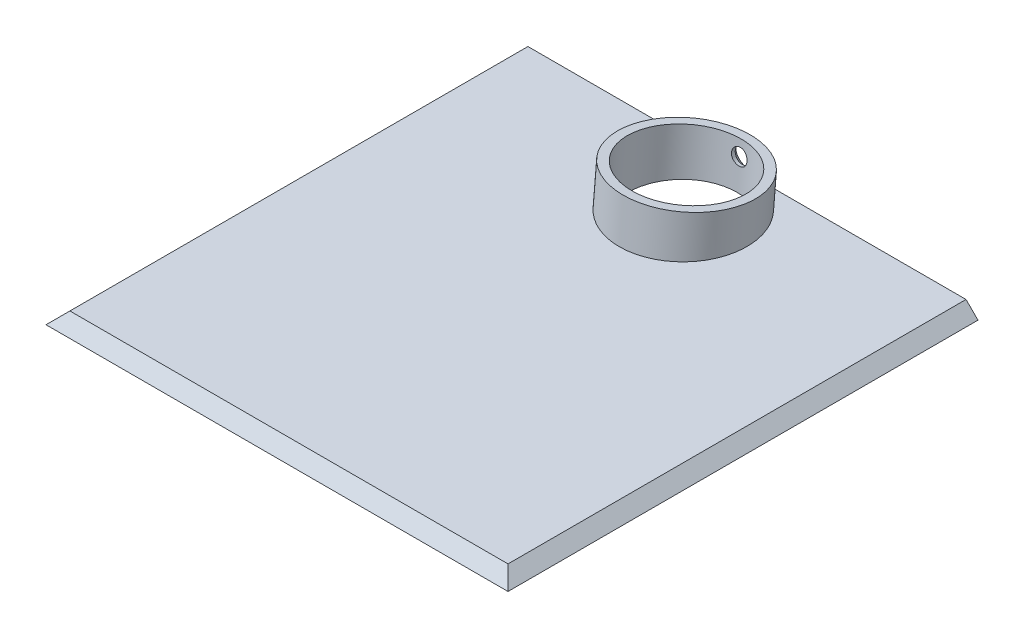
ISO-10303-21;
HEADER;
FILE_DESCRIPTION(('STEP AP214'),'2;1');
FILE_NAME('part.step','',(''),(''),'','','');
FILE_SCHEMA(('AUTOMOTIVE_DESIGN { 1 0 10303 214 1 1 1 1 }'));
ENDSEC;
DATA;
#1=APPLICATION_CONTEXT('core data for automotive mechanical design processes');
#2=APPLICATION_PROTOCOL_DEFINITION('international standard','automotive_design',2000,#1);
#3=PRODUCT_CONTEXT('',#1,'mechanical');
#4=PRODUCT('Part','Part','',(#3));
#5=PRODUCT_RELATED_PRODUCT_CATEGORY('part','',(#4));
#6=PRODUCT_DEFINITION_FORMATION('','',#4);
#7=PRODUCT_DEFINITION_CONTEXT('part definition',#1,'design');
#8=PRODUCT_DEFINITION('design','',#6,#7);
#9=PRODUCT_DEFINITION_SHAPE('','',#8);
#10=(LENGTH_UNIT() NAMED_UNIT(*) SI_UNIT(.MILLI.,.METRE.));
#11=(NAMED_UNIT(*) PLANE_ANGLE_UNIT() SI_UNIT($,.RADIAN.));
#12=(NAMED_UNIT(*) SI_UNIT($,.STERADIAN.) SOLID_ANGLE_UNIT());
#13=UNCERTAINTY_MEASURE_WITH_UNIT(LENGTH_MEASURE(1.E-05),#10,'distance_accuracy_value','');
#14=(GEOMETRIC_REPRESENTATION_CONTEXT(3) GLOBAL_UNCERTAINTY_ASSIGNED_CONTEXT((#13)) GLOBAL_UNIT_ASSIGNED_CONTEXT((#10,
#11,#12)) REPRESENTATION_CONTEXT('',''));
#15=CARTESIAN_POINT('',(0.,0.,0.));
#16=DIRECTION('',(0.,0.,1.));
#17=DIRECTION('',(1.,0.,0.));
#18=AXIS2_PLACEMENT_3D('',#15,#16,#17);
#19=CARTESIAN_POINT('',(-60.,-3.,-16.));
#20=DIRECTION('',(0.,0.,-1.));
#21=DIRECTION('',(-1.,0.,0.));
#22=AXIS2_PLACEMENT_3D('',#19,#20,#21);
#23=PLANE('',#22);
#24=DIRECTION('',(-1.,0.,0.));
#25=VECTOR('',#24,1.);
#26=CARTESIAN_POINT('',(-60.,0.,-16.));
#27=LINE('',#26,#25);
#28=CARTESIAN_POINT('',(54.9999999999999,0.,-16.));
#29=VERTEX_POINT('',#28);
#30=CARTESIAN_POINT('',(1.39449188396251,0.,-16.));
#31=VERTEX_POINT('',#30);
#32=EDGE_CURVE('E106',#29,#31,#27,.T.);
#33=ORIENTED_EDGE('',*,*,#32,.F.);
#34=DIRECTION('',(-0.707106781186551,0.707106781186544,0.));
#35=VECTOR('',#34,1.);
#36=CARTESIAN_POINT('',(-1.00000000000067,56.,-16.));
#37=LINE('',#36,#35);
#38=CARTESIAN_POINT('',(57.9999999999999,-3.,-16.));
#39=VERTEX_POINT('',#38);
#40=EDGE_CURVE('E150',#29,#39,#37,.F.);
#41=ORIENTED_EDGE('',*,*,#40,.T.);
#42=DIRECTION('',(-1.,0.,0.));
#43=VECTOR('',#42,1.);
#44=CARTESIAN_POINT('',(-60.,-3.,-16.));
#45=LINE('',#44,#43);
#46=CARTESIAN_POINT('',(-57.9999999999999,-3.,-16.));
#47=VERTEX_POINT('',#46);
#48=EDGE_CURVE('E135',#39,#47,#45,.T.);
#49=ORIENTED_EDGE('',*,*,#48,.T.);
#50=DIRECTION('',(-0.707106781186551,-0.707106781186544,0.));
#51=VECTOR('',#50,1.);
#52=CARTESIAN_POINT('',(-59.,-4.00000000000003,-16.));
#53=LINE('',#52,#51);
#54=CARTESIAN_POINT('',(-54.9999999999999,0.,-16.));
#55=VERTEX_POINT('',#54);
#56=EDGE_CURVE('E102',#47,#55,#53,.F.);
#57=ORIENTED_EDGE('',*,*,#56,.T.);
#58=CARTESIAN_POINT('',(-1.39449188396251,0.,-16.));
#59=VERTEX_POINT('',#58);
#60=EDGE_CURVE('E94',#59,#55,#27,.T.);
#61=ORIENTED_EDGE('',*,*,#60,.F.);
#62=DIRECTION('',(1.,0.,0.));
#63=VECTOR('',#62,1.);
#64=CARTESIAN_POINT('',(0.,0.,-16.));
#65=LINE('',#64,#63);
#66=EDGE_CURVE('E98',#59,#31,#65,.T.);
#67=ORIENTED_EDGE('',*,*,#66,.T.);
#68=EDGE_LOOP('',(#33,#41,#49,#57,#61,#67));
#69=FACE_BOUND('',#68,.T.);
#70=ADVANCED_FACE('F41',(#69),#23,.T.);
#71=CARTESIAN_POINT('',(0.,-3.,0.));
#72=DIRECTION('',(0.,1.,0.));
#73=DIRECTION('',(0.,0.,1.));
#74=AXIS2_PLACEMENT_3D('',#71,#72,#73);
#75=PLANE('',#74);
#76=CARTESIAN_POINT('',(0.,-3.,0.262465990577772));
#77=DIRECTION('',(0.,1.,0.));
#78=DIRECTION('',(0.,0.,-1.));
#79=AXIS2_PLACEMENT_3D('',#76,#77,#78);
#80=ELLIPSE('',#79,13.802522766221,13.75);
#81=CARTESIAN_POINT('',(0.,-3.,-13.5400567756433));
#82=VERTEX_POINT('',#81);
#83=EDGE_CURVE('E125',#82,#82,#80,.T.);
#84=ORIENTED_EDGE('',*,*,#83,.T.);
#85=EDGE_LOOP('',(#84));
#86=FACE_BOUND('',#85,.T.);
#87=ORIENTED_EDGE('',*,*,#48,.F.);
#88=DIRECTION('',(0.,0.,-1.));
#89=VECTOR('',#88,1.);
#90=CARTESIAN_POINT('',(57.9999999999999,-3.,0.));
#91=LINE('',#90,#89);
#92=CARTESIAN_POINT('',(58.,-3.,102.));
#93=VERTEX_POINT('',#92);
#94=EDGE_CURVE('E57',#39,#93,#91,.F.);
#95=ORIENTED_EDGE('',*,*,#94,.T.);
#96=DIRECTION('',(1.,0.,0.));
#97=VECTOR('',#96,1.);
#98=CARTESIAN_POINT('',(0.,-3.,102.));
#99=LINE('',#98,#97);
#100=CARTESIAN_POINT('',(-57.9999999999999,-3.,102.));
#101=VERTEX_POINT('',#100);
#102=EDGE_CURVE('E67',#93,#101,#99,.F.);
#103=ORIENTED_EDGE('',*,*,#102,.T.);
#104=DIRECTION('',(0.,0.,1.));
#105=VECTOR('',#104,1.);
#106=CARTESIAN_POINT('',(-57.9999999999999,-3.,0.));
#107=LINE('',#106,#105);
#108=EDGE_CURVE('E153',#101,#47,#107,.F.);
#109=ORIENTED_EDGE('',*,*,#108,.T.);
#110=EDGE_LOOP('',(#87,#95,#103,#109));
#111=FACE_BOUND('',#110,.T.);
#112=ADVANCED_FACE('F196',(#86,#111),#75,.F.);
#113=CARTESIAN_POINT('',(0.,0.,0.));
#114=DIRECTION('',(0.,1.,0.));
#115=DIRECTION('',(0.,0.,1.));
#116=AXIS2_PLACEMENT_3D('',#113,#114,#115);
#117=PLANE('',#116);
#118=DIRECTION('',(1.,0.,0.));
#119=VECTOR('',#118,1.);
#120=CARTESIAN_POINT('',(0.,0.,98.9999999999999));
#121=LINE('',#120,#119);
#122=CARTESIAN_POINT('',(-54.9999999999999,0.,98.9999999999999));
#123=VERTEX_POINT('',#122);
#124=CARTESIAN_POINT('',(54.9999999999999,0.,98.9999999999999));
#125=VERTEX_POINT('',#124);
#126=EDGE_CURVE('E142',#123,#125,#121,.T.);
#127=ORIENTED_EDGE('',*,*,#126,.T.);
#128=DIRECTION('',(0.,0.,-1.));
#129=VECTOR('',#128,1.);
#130=CARTESIAN_POINT('',(54.9999999999999,0.,0.));
#131=LINE('',#130,#129);
#132=EDGE_CURVE('E145',#125,#29,#131,.T.);
#133=ORIENTED_EDGE('',*,*,#132,.T.);
#134=ORIENTED_EDGE('',*,*,#32,.T.);
#135=CARTESIAN_POINT('',(0.,0.,0.));
#136=DIRECTION('',(0.,1.,0.));
#137=DIRECTION('',(0.,0.,-1.));
#138=AXIS2_PLACEMENT_3D('',#135,#136,#137);
#139=ELLIPSE('',#138,16.0611174006936,16.);
#140=EDGE_CURVE('E109',#31,#59,#139,.F.);
#141=ORIENTED_EDGE('',*,*,#140,.T.);
#142=ORIENTED_EDGE('',*,*,#60,.T.);
#143=DIRECTION('',(0.,0.,1.));
#144=VECTOR('',#143,1.);
#145=CARTESIAN_POINT('',(-54.9999999999999,0.,0.));
#146=LINE('',#145,#144);
#147=EDGE_CURVE('E137',#55,#123,#146,.T.);
#148=ORIENTED_EDGE('',*,*,#147,.T.);
#149=EDGE_LOOP('',(#127,#133,#134,#141,#142,#148));
#150=FACE_BOUND('',#149,.T.);
#151=ADVANCED_FACE('F110',(#150),#117,.T.);
#152=CARTESIAN_POINT('',(0.,-45.1687298428578,3.95175180711516));
#153=DIRECTION('',(0.,0.996194698091745,-0.0871557427476583));
#154=DIRECTION('',(0.,0.0871557427476584,0.996194698091746));
#155=AXIS2_PLACEMENT_3D('',#152,#153,#154);
#156=CYLINDRICAL_SURFACE('',#155,16.);
#157=CARTESIAN_POINT('',(-2.40172815119955,2.39829457248427,-16.0889621677331));
#158=CARTESIAN_POINT('',(-2.4874439298456,2.52755947040419,-16.0872082962869));
#159=CARTESIAN_POINT('',(-2.56392416489513,2.6629922172885,-16.0866902215449));
#160=CARTESIAN_POINT('',(-2.69737326364871,2.94319321563681,-16.0888760298624));
#161=CARTESIAN_POINT('',(-2.75432719382974,3.08796851209359,-16.0915823718763));
#162=CARTESIAN_POINT('',(-2.85698758571233,3.41254402198997,-16.1016579117201));
#163=CARTESIAN_POINT('',(-2.89838363523585,3.59369986978438,-16.1098282082629));
#164=CARTESIAN_POINT('',(-2.95142799758228,3.9599973702744,-16.1319741929398));
#165=CARTESIAN_POINT('',(-2.96306438452369,4.14514059090747,-16.1459522058494));
#166=CARTESIAN_POINT('',(-2.95627614045057,4.51869056536239,-16.1799169332704));
#167=CARTESIAN_POINT('',(-2.93714623284495,4.70707310301673,-16.2000358059644));
#168=CARTESIAN_POINT('',(-2.86785373732505,5.07743375498071,-16.2452681164757));
#169=CARTESIAN_POINT('',(-2.81769020519187,5.25941167424747,-16.2703817062448));
#170=CARTESIAN_POINT('',(-2.68733251086136,5.61166610157255,-16.3240506074837));
#171=CARTESIAN_POINT('',(-2.60715196618564,5.78194787431247,-16.3526043543139));
#172=CARTESIAN_POINT('',(-2.4183235506541,6.10572946027465,-16.4110713563046));
#173=CARTESIAN_POINT('',(-2.30967631497918,6.25922964783825,-16.4409845811185));
#174=CARTESIAN_POINT('',(-2.06988369014265,6.53995469320442,-16.4987710683098));
#175=CARTESIAN_POINT('',(-1.9395071215604,6.66782735929445,-16.5266785740916));
#176=CARTESIAN_POINT('',(-1.65720041188642,6.89801115379508,-16.5788665396731));
#177=CARTESIAN_POINT('',(-1.50528110255866,7.00033505726034,-16.6031488097341));
#178=CARTESIAN_POINT('',(-1.1956492322457,7.16861925186987,-16.6440863072077));
#179=CARTESIAN_POINT('',(-1.03911951361378,7.23665007974222,-16.6611615155318));
#180=CARTESIAN_POINT('',(-0.715841464959473,7.34354956070182,-16.6883320168346));
#181=CARTESIAN_POINT('',(-0.549099896064706,7.38243728800774,-16.6984318748541));
#182=CARTESIAN_POINT('',(-0.224964343416673,7.4271626966264,-16.7100787136619));
#183=CARTESIAN_POINT('',(-0.0679281572801225,7.43545362951202,-16.7122603157917));
#184=CARTESIAN_POINT('',(0.2452167085585,7.425450782655,-16.7096421588157));
#185=CARTESIAN_POINT('',(0.401325582751342,7.40716279047795,-16.7048439195713));
#186=CARTESIAN_POINT('',(0.702854990831303,7.3458865931842,-16.6889871201795));
#187=CARTESIAN_POINT('',(0.848458235006346,7.30373325115071,-16.6781403353954));
#188=CARTESIAN_POINT('',(1.13068862134563,7.19705845491694,-16.6512532268065));
#189=CARTESIAN_POINT('',(1.26731463289475,7.13253418966515,-16.6352122503345));
#190=CARTESIAN_POINT('',(1.53340255762195,6.98059772272658,-16.5984945571636));
#191=CARTESIAN_POINT('',(1.6624044502651,6.89241875250854,-16.577666708436));
#192=CARTESIAN_POINT('',(1.90480452587542,6.69731856967395,-16.5333048111724));
#193=CARTESIAN_POINT('',(2.0181977727891,6.5903914523687,-16.5097699108619));
#194=CARTESIAN_POINT('',(2.2355593717849,6.35181874067427,-16.4596920004472));
#195=CARTESIAN_POINT('',(2.3381052721185,6.2188964141353,-16.4330574813147));
#196=CARTESIAN_POINT('',(2.52096844358411,5.93846341058033,-16.3803240662904));
#197=CARTESIAN_POINT('',(2.60127830206546,5.79094789093867,-16.3542253516934));
#198=CARTESIAN_POINT('',(2.74331115688379,5.47396554082148,-16.3023660149754));
#199=CARTESIAN_POINT('',(2.80327590118527,5.30368285228704,-16.2767655302963));
#200=CARTESIAN_POINT('',(2.89506628679963,4.95515877521389,-16.2295997951617));
#201=CARTESIAN_POINT('',(2.9268861736921,4.77691576695206,-16.2080353706182));
#202=CARTESIAN_POINT('',(2.96247414759877,4.41022340018605,-16.1692671230853));
#203=CARTESIAN_POINT('',(2.96512701417727,4.22164394752741,-16.1522607927386));
#204=CARTESIAN_POINT('',(2.93942147180278,3.84614502575732,-16.1242526969272));
#205=CARTESIAN_POINT('',(2.91105967167435,3.65922574042332,-16.1132515882768));
#206=CARTESIAN_POINT('',(2.82352612140504,3.29092692040242,-16.097035435466));
#207=CARTESIAN_POINT('',(2.7641172228742,3.10960156639185,-16.0918659087219));
#208=CARTESIAN_POINT('',(2.6154980801267,2.75947483649714,-16.0866743721422));
#209=CARTESIAN_POINT('',(2.52628658974112,2.5906739846747,-16.0866525775814));
#210=CARTESIAN_POINT('',(2.32169531477875,2.27397839295412,-16.0904083318663));
#211=CARTESIAN_POINT('',(2.20680619316472,2.12576673524242,-16.0941186993835));
#212=CARTESIAN_POINT('',(1.95247629194037,1.85217543268699,-16.1036458908304));
#213=CARTESIAN_POINT('',(1.81304321918947,1.72678864584535,-16.1094620541393));
#214=CARTESIAN_POINT('',(1.52176660281914,1.51059654166847,-16.1211036044292));
#215=CARTESIAN_POINT('',(1.37108853116048,1.41822384491707,-16.1269094487608));
#216=CARTESIAN_POINT('',(1.05525274134807,1.26283357435265,-16.1374165764179));
#217=CARTESIAN_POINT('',(0.890105142082953,1.19979567766412,-16.1421186233215));
#218=CARTESIAN_POINT('',(0.56522953978315,1.11037028926857,-16.1489953947171));
#219=CARTESIAN_POINT('',(0.406236392851978,1.08132029699841,-16.1513511468846));
#220=CARTESIAN_POINT('',(0.0856214811485255,1.05199386738204,-16.1537297317091));
#221=CARTESIAN_POINT('',(-0.0759992034063422,1.05170589050942,-16.1537534999747));
#222=CARTESIAN_POINT('',(-0.387692352520575,1.07909784870843,-16.151531106473));
#223=CARTESIAN_POINT('',(-0.537906085857425,1.10521853064624,-16.1494114954867));
#224=CARTESIAN_POINT('',(-0.83190919820576,1.18191971701746,-16.1434778325349));
#225=CARTESIAN_POINT('',(-0.975697813909147,1.23250311924283,-16.1396635798309));
#226=CARTESIAN_POINT('',(-1.25521321517787,1.35695158450649,-16.1309620332566));
#227=CARTESIAN_POINT('',(-1.39079462358515,1.43114046743124,-16.1260601203161));
#228=CARTESIAN_POINT('',(-1.64859711010613,1.59981887039617,-16.116127410798));
#229=CARTESIAN_POINT('',(-1.77082018464803,1.69430535064548,-16.1110966336185));
#230=CARTESIAN_POINT('',(-1.98356661675526,1.88608274782039,-16.1025372320634));
#231=CARTESIAN_POINT('',(-2.07613194059307,1.98112425215775,-16.0988968941505));
#232=CARTESIAN_POINT('',(-2.24861713567211,2.18204442296897,-16.0928582512344));
#233=CARTESIAN_POINT('',(-2.32853931393275,2.28792110650624,-16.0904597194546));
#234=CARTESIAN_POINT('',(-2.40172815119955,2.39829457248427,-16.0889621677331));
#235=B_SPLINE_CURVE_WITH_KNOTS('',3,(#157,#158,#159,#160,#161,#162,#163,#164,#165,#166,#167,
#168,#169,#170,#171,#172,#173,#174,#175,#176,#177,#178,#179,#180,#181,#182,#183,#184,#185,#186,
#187,#188,#189,#190,#191,#192,#193,#194,#195,#196,#197,#198,#199,#200,#201,#202,#203,#204,#205,
#206,#207,#208,#209,#210,#211,#212,#213,#214,#215,#216,#217,#218,#219,#220,#221,#222,#223,#224,
#225,#226,#227,#228,#229,#230,#231,#232,#233,#234),.UNSPECIFIED.,.T.,.F.,(4,2,2,2,2,2,2,2,2,2,2,
2,2,2,2,2,2,2,2,2,2,2,2,2,2,2,2,2,2,2,2,2,2,2,2,2,2,2,4),(0.,0.464986714160529,
0.930328256353317,1.48573496510294,2.04136421257954,2.60991306978844,3.17847922632945,
3.74678775903071,4.31508361207109,4.86640713741144,5.41745443188076,5.92926279903073,
6.44073589330354,6.91017940762349,7.37952071584989,7.8333766516756,8.28728963812319,
8.75820445041009,9.22926784359264,9.73702943506322,10.2449600916941,10.7895235881023,
11.3341983987511,11.8996299090671,12.4651232504261,13.0350005571716,13.6049016958137,
14.1647246194023,14.7243720698092,15.2520197178298,15.7793012702712,16.2617096943869,
16.7439245720126,17.1992397945391,17.6546089657714,18.1165156950372,18.5783532968006,
18.9754570233719,19.3724882058621),.UNSPECIFIED.);
#236=CARTESIAN_POINT('',(-2.40172815119955,2.39829457248427,-16.0889621677331));
#237=VERTEX_POINT('',#236);
#238=EDGE_CURVE('E11',#237,#237,#235,.T.);
#239=ORIENTED_EDGE('',*,*,#238,.F.);
#240=EDGE_LOOP('',(#239));
#241=FACE_BOUND('',#240,.T.);
#242=ORIENTED_EDGE('',*,*,#140,.F.);
#243=CARTESIAN_POINT('',(0.,1.38918542133545,-0.121537975902336));
#244=DIRECTION('',(0.,0.996194698091746,-0.0871557427476584));
#245=DIRECTION('',(0.,0.0871557427476584,0.996194698091746));
#246=AXIS2_PLACEMENT_3D('',#243,#244,#245);
#247=CIRCLE('',#246,16.);
#248=EDGE_CURVE('E119',#31,#59,#247,.T.);
#249=ORIENTED_EDGE('',*,*,#248,.T.);
#250=EDGE_LOOP('',(#242,#249));
#251=FACE_BOUND('',#250,.T.);
#252=CARTESIAN_POINT('',(0.,9.35874300606941,-0.818783917883603));
#253=DIRECTION('',(0.,0.996194698091746,-0.0871557427476584));
#254=DIRECTION('',(0.,0.0871557427476584,0.996194698091746));
#255=AXIS2_PLACEMENT_3D('',#252,#253,#254);
#256=CIRCLE('',#255,16.);
#257=CARTESIAN_POINT('',(0.,10.7532348900319,15.1203312515843));
#258=VERTEX_POINT('',#257);
#259=EDGE_CURVE('E115',#258,#258,#256,.T.);
#260=ORIENTED_EDGE('',*,*,#259,.F.);
#261=EDGE_LOOP('',(#260));
#262=FACE_BOUND('',#261,.T.);
#263=ADVANCED_FACE('F122',(#241,#251,#262),#156,.T.);
#264=CARTESIAN_POINT('',(0.,9.35874300606941,-0.818783917883603));
#265=DIRECTION('',(0.,0.996194698091746,-0.0871557427476584));
#266=DIRECTION('',(0.,0.0871557427476584,0.996194698091746));
#267=AXIS2_PLACEMENT_3D('',#264,#265,#266);
#268=PLANE('',#267);
#269=CARTESIAN_POINT('',(0.,9.35874300606941,-0.818783917883603));
#270=DIRECTION('',(0.,0.996194698091746,-0.0871557427476584));
#271=DIRECTION('',(0.,0.0871557427476584,0.996194698091746));
#272=AXIS2_PLACEMENT_3D('',#269,#270,#271);
#273=CIRCLE('',#272,13.75);
#274=CARTESIAN_POINT('',(0.,10.5571344688497,12.8788931808779));
#275=VERTEX_POINT('',#274);
#276=EDGE_CURVE('E132',#275,#275,#273,.T.);
#277=ORIENTED_EDGE('',*,*,#276,.F.);
#278=EDGE_LOOP('',(#277));
#279=FACE_BOUND('',#278,.T.);
#280=ORIENTED_EDGE('',*,*,#259,.T.);
#281=EDGE_LOOP('',(#280));
#282=FACE_BOUND('',#281,.T.);
#283=ADVANCED_FACE('F189',(#279,#282),#268,.T.);
#284=CARTESIAN_POINT('',(0.,1.38918542133545,-0.121537975902336));
#285=DIRECTION('',(0.,0.996194698091746,-0.0871557427476584));
#286=DIRECTION('',(0.,0.0871557427476584,0.996194698091746));
#287=AXIS2_PLACEMENT_3D('',#284,#285,#286);
#288=PLANE('',#287);
#289=ORIENTED_EDGE('',*,*,#66,.F.);
#290=ORIENTED_EDGE('',*,*,#248,.F.);
#291=EDGE_LOOP('',(#289,#290));
#292=FACE_BOUND('',#291,.T.);
#293=ADVANCED_FACE('F118',(#292),#288,.F.);
#294=CARTESIAN_POINT('',(0.,-12.0069168681987,1.05046910986558));
#295=DIRECTION('',(0.,0.996194698091746,-0.0871557427476583));
#296=DIRECTION('',(0.,0.0871557427476583,0.996194698091746));
#297=AXIS2_PLACEMENT_3D('',#294,#295,#296);
#298=CYLINDRICAL_SURFACE('',#297,13.75);
#299=CARTESIAN_POINT('',(0.,6.38810322598882,-14.3614093799284));
#300=CARTESIAN_POINT('',(0.109266584571147,6.38809883609243,-14.3614073033931));
#301=CARTESIAN_POINT('',(0.218598182939476,6.37906524189236,-14.3592974897856));
#302=CARTESIAN_POINT('',(0.434209895822868,6.34316702639554,-14.3510201142647));
#303=CARTESIAN_POINT('',(0.540486857909236,6.31628462879312,-14.3448485071094));
#304=CARTESIAN_POINT('',(0.746837396145821,6.24547733252618,-14.3289461303837));
#305=CARTESIAN_POINT('',(0.846915431453807,6.20156485340579,-14.3192179548109));
#306=CARTESIAN_POINT('',(1.03815142118541,6.09793147520456,-14.2969622398834));
#307=CARTESIAN_POINT('',(1.12931070698034,6.03821294056363,-14.2844351192686));
#308=CARTESIAN_POINT('',(1.30078110042068,5.90416095503685,-14.2574414546303));
#309=CARTESIAN_POINT('',(1.38102018420852,5.82973772851195,-14.2429631802011));
#310=CARTESIAN_POINT('',(1.52775141972202,5.66852179862908,-14.2131922333444));
#311=CARTESIAN_POINT('',(1.59424281171126,5.58172841210851,-14.1978995159672));
#312=CARTESIAN_POINT('',(1.71186780811287,5.39770532841078,-14.1675028253224));
#313=CARTESIAN_POINT('',(1.76293242225508,5.30043131369389,-14.1523999812074));
#314=CARTESIAN_POINT('',(1.84781354659819,5.09845471717614,-14.1234450269605));
#315=CARTESIAN_POINT('',(1.88163090162961,4.99375249952062,-14.1095928555936));
#316=CARTESIAN_POINT('',(1.93083537558043,4.78060540659189,-14.0840307702181));
#317=CARTESIAN_POINT('',(1.94634529393362,4.67219054643517,-14.0723070340587));
#318=CARTESIAN_POINT('',(1.95887490407754,4.45405651088998,-14.0514185712284));
#319=CARTESIAN_POINT('',(1.95589555217374,4.344337403253,-14.0422537122325));
#320=CARTESIAN_POINT('',(1.93163169428582,4.1275742070003,-14.0267670306992));
#321=CARTESIAN_POINT('',(1.91048345831962,4.02051629443572,-14.020424575853));
#322=CARTESIAN_POINT('',(1.85069523875618,3.81127264354964,-14.0104038901395));
#323=CARTESIAN_POINT('',(1.81205480619867,3.70908703035655,-14.0067257276609));
#324=CARTESIAN_POINT('',(1.71823577040532,3.51210938819834,-14.0016829830806));
#325=CARTESIAN_POINT('',(1.66299895556122,3.41734488829508,-14.0003266588267));
#326=CARTESIAN_POINT('',(1.53759664144694,3.23825818750859,-13.9994086604874));
#327=CARTESIAN_POINT('',(1.46743025987829,3.15393660424065,-13.9998470924952));
#328=CARTESIAN_POINT('',(1.3134101947446,2.99739188539513,-14.0018688783564));
#329=CARTESIAN_POINT('',(1.22943925084049,2.92528420084721,-14.0034624788575));
#330=CARTESIAN_POINT('',(1.05059468069835,2.79618006539438,-14.0071024735366));
#331=CARTESIAN_POINT('',(0.955721015009836,2.73918366917074,-14.009148869353));
#332=CARTESIAN_POINT('',(0.75766730463163,2.64196694926422,-14.0130539949049));
#333=CARTESIAN_POINT('',(0.654483118363238,2.60175505268712,-14.0149126300161));
#334=CARTESIAN_POINT('',(0.442786345925123,2.53938626165595,-14.0179411980027));
#335=CARTESIAN_POINT('',(0.334274083787541,2.51722827067438,-14.0191111727037));
#336=CARTESIAN_POINT('',(0.116002360742338,2.49177285147721,-14.0204645177948));
#337=CARTESIAN_POINT('',(0.00626169040790885,2.48831462928975,-14.020656298581));
#338=CARTESIAN_POINT('',(-0.212228213416646,2.49993441661693,-14.0200302061905));
#339=CARTESIAN_POINT('',(-0.320977474338268,2.51501191168551,-14.0192123610352));
#340=CARTESIAN_POINT('',(-0.533918703974173,2.56312629772062,-14.0167705804757));
#341=CARTESIAN_POINT('',(-0.638128305227577,2.59608544990028,-14.0151501369271));
#342=CARTESIAN_POINT('',(-0.839586750823359,2.67891427511616,-14.0115150252831));
#343=CARTESIAN_POINT('',(-0.936835297015301,2.72878467195726,-14.0095003403156));
#344=CARTESIAN_POINT('',(-1.12231587182145,2.8443558103886,-14.0056357627955));
#345=CARTESIAN_POINT('',(-1.21048430261546,2.91015864282666,-14.0037870428949));
#346=CARTESIAN_POINT('',(-1.3746521621093,3.05552782474147,-14.0009457957843));
#347=CARTESIAN_POINT('',(-1.45065095792857,3.13509488957832,-13.9999533130912));
#348=CARTESIAN_POINT('',(-1.58889766647449,3.30638657279445,-13.9995098155769));
#349=CARTESIAN_POINT('',(-1.65103907620984,3.39819723139015,-14.000070323128));
#350=CARTESIAN_POINT('',(-1.75906825412872,3.59089514391521,-14.00337837106));
#351=CARTESIAN_POINT('',(-1.80495642578835,3.69178217245158,-14.0061258571451));
#352=CARTESIAN_POINT('',(-1.87900902175679,3.89939686970421,-14.014241443364));
#353=CARTESIAN_POINT('',(-1.90723080555259,4.00610440047694,-14.0196009608372));
#354=CARTESIAN_POINT('',(-1.94533283609848,4.2225707163195,-14.0331281800783));
#355=CARTESIAN_POINT('',(-1.95521421143932,4.33232931321778,-14.0412957090163));
#356=CARTESIAN_POINT('',(-1.95633009549151,4.55071428452673,-14.0602408634525));
#357=CARTESIAN_POINT('',(-1.94773200625855,4.65934194106341,-14.0709942796835));
#358=CARTESIAN_POINT('',(-1.91249036662184,4.87337575367251,-14.0947349386163));
#359=CARTESIAN_POINT('',(-1.88584683397961,4.97878191291562,-14.1077221791193));
#360=CARTESIAN_POINT('',(-1.8153276110159,5.18337062135262,-14.1352353899085));
#361=CARTESIAN_POINT('',(-1.77146243711224,5.28255692592214,-14.1497604171973));
#362=CARTESIAN_POINT('',(-1.66776162667921,5.4720858854087,-14.1794628410265));
#363=CARTESIAN_POINT('',(-1.60792556011297,5.5624283021031,-14.194640255124));
#364=CARTESIAN_POINT('',(-1.47336887279206,5.73260053119499,-14.2247605323301));
#365=CARTESIAN_POINT('',(-1.3985239658398,5.8123326395544,-14.2397002305338));
#366=CARTESIAN_POINT('',(-1.23633639416859,5.95822639866437,-14.2681343942247));
#367=CARTESIAN_POINT('',(-1.14899081663504,6.02438487781933,-14.2816285215906));
#368=CARTESIAN_POINT('',(-0.963778277725915,6.14159642537119,-14.3062119874643));
#369=CARTESIAN_POINT('',(-0.865861597320806,6.19257346255211,-14.3172891498678));
#370=CARTESIAN_POINT('',(-0.662682027976276,6.27750080978296,-14.3360704295909));
#371=CARTESIAN_POINT('',(-0.557427005207814,6.31146904183128,-14.3437780962204));
#372=CARTESIAN_POINT('',(-0.376395806889727,6.35360266198105,-14.3534178252632));
#373=CARTESIAN_POINT('',(-0.301745583305607,6.3665215703798,-14.356403599244));
#374=CARTESIAN_POINT('',(-0.151407306050553,6.38377332784762,-14.3604000855866));
#375=CARTESIAN_POINT('',(-0.0757192634083647,6.38810626808739,-14.3614108189203));
#376=CARTESIAN_POINT('',(0.,6.38810322598882,-14.3614093799284));
#377=B_SPLINE_CURVE_WITH_KNOTS('',3,(#299,#300,#301,#302,#303,#304,#305,#306,#307,#308,#309,
#310,#311,#312,#313,#314,#315,#316,#317,#318,#319,#320,#321,#322,#323,#324,#325,#326,#327,#328,
#329,#330,#331,#332,#333,#334,#335,#336,#337,#338,#339,#340,#341,#342,#343,#344,#345,#346,#347,
#348,#349,#350,#351,#352,#353,#354,#355,#356,#357,#358,#359,#360,#361,#362,#363,#364,#365,#366,
#367,#368,#369,#370,#371,#372,#373,#374,#375,#376),.UNSPECIFIED.,.T.,.F.,(4,2,2,2,2,2,2,2,2,2,2,
2,2,2,2,2,2,2,2,2,2,2,2,2,2,2,2,2,2,2,2,2,2,2,2,2,2,2,4),(0.,0.327523103806627,
0.655372890665541,0.982984034430811,1.31054619826639,1.6401737026185,1.96981941825524,
2.30091823668437,2.63200083518812,2.96084980241005,3.28968176098628,3.616068737448,
3.94246409153664,4.27001790967981,4.59759109077908,4.92810605334074,5.25862221187816,
5.58930411583937,5.91996593390628,6.24777991011078,6.57558478826963,6.90197585411415,
7.2283808913295,7.55693553199445,7.88550725356323,8.21652331943214,8.54753116746578,
8.87745864284669,9.20736581522069,9.53429702355861,9.86122791010978,10.1879594656312,
10.5146998197088,10.8442667583158,11.1739106156026,11.5051786457118,11.8360968837838,
12.0630653719954,12.2900314501133),.UNSPECIFIED.);
#378=CARTESIAN_POINT('',(0.,6.38810322598882,-14.3614093799284));
#379=VERTEX_POINT('',#378);
#380=EDGE_CURVE('E46',#379,#379,#377,.T.);
#381=ORIENTED_EDGE('',*,*,#380,.T.);
#382=EDGE_LOOP('',(#381));
#383=FACE_BOUND('',#382,.T.);
#384=ORIENTED_EDGE('',*,*,#276,.T.);
#385=EDGE_LOOP('',(#384));
#386=FACE_BOUND('',#385,.T.);
#387=ORIENTED_EDGE('',*,*,#83,.F.);
#388=EDGE_LOOP('',(#387));
#389=FACE_BOUND('',#388,.T.);
#390=ADVANCED_FACE('F184',(#383,#386,#389),#298,.F.);
#391=CARTESIAN_POINT('',(-54.9999999999999,0.,0.));
#392=DIRECTION('',(0.707106781186544,-0.707106781186551,0.));
#393=DIRECTION('',(0.,0.,1.));
#394=AXIS2_PLACEMENT_3D('',#391,#392,#393);
#395=PLANE('',#394);
#396=ORIENTED_EDGE('',*,*,#56,.F.);
#397=ORIENTED_EDGE('',*,*,#108,.F.);
#398=DIRECTION('',(0.577350269189628,0.577350269189622,-0.577350269189628));
#399=VECTOR('',#398,1.);
#400=CARTESIAN_POINT('',(-21.9999999999997,32.9999999999999,65.9999999999997));
#401=LINE('',#400,#399);
#402=EDGE_CURVE('E164',#123,#101,#401,.F.);
#403=ORIENTED_EDGE('',*,*,#402,.F.);
#404=ORIENTED_EDGE('',*,*,#147,.F.);
#405=EDGE_LOOP('',(#396,#397,#403,#404));
#406=FACE_BOUND('',#405,.T.);
#407=ADVANCED_FACE('F44',(#406),#395,.F.);
#408=CARTESIAN_POINT('',(0.,0.,98.9999999999999));
#409=DIRECTION('',(0.,-0.707106781186551,-0.707106781186544));
#410=DIRECTION('',(1.,0.,0.));
#411=AXIS2_PLACEMENT_3D('',#408,#409,#410);
#412=PLANE('',#411);
#413=ORIENTED_EDGE('',*,*,#402,.T.);
#414=ORIENTED_EDGE('',*,*,#102,.F.);
#415=DIRECTION('',(-0.577350269189628,0.577350269189622,-0.577350269189628));
#416=VECTOR('',#415,1.);
#417=CARTESIAN_POINT('',(36.6666666666665,18.3333333333333,80.6666666666665));
#418=LINE('',#417,#416);
#419=EDGE_CURVE('E160',#125,#93,#418,.F.);
#420=ORIENTED_EDGE('',*,*,#419,.F.);
#421=ORIENTED_EDGE('',*,*,#126,.F.);
#422=EDGE_LOOP('',(#413,#414,#420,#421));
#423=FACE_BOUND('',#422,.T.);
#424=ADVANCED_FACE('F209',(#423),#412,.F.);
#425=CARTESIAN_POINT('',(54.9999999999999,0.,0.));
#426=DIRECTION('',(-0.707106781186544,-0.707106781186551,0.));
#427=DIRECTION('',(0.,0.,-1.));
#428=AXIS2_PLACEMENT_3D('',#425,#426,#427);
#429=PLANE('',#428);
#430=ORIENTED_EDGE('',*,*,#419,.T.);
#431=ORIENTED_EDGE('',*,*,#94,.F.);
#432=ORIENTED_EDGE('',*,*,#40,.F.);
#433=ORIENTED_EDGE('',*,*,#132,.F.);
#434=EDGE_LOOP('',(#430,#431,#432,#433));
#435=FACE_BOUND('',#434,.T.);
#436=ADVANCED_FACE('F182',(#435),#429,.F.);
#437=CARTESIAN_POINT('',(0.,4.24364521427877,-16.432388248969));
#438=DIRECTION('',(0.,-0.0871557427476579,-0.996194698091746));
#439=DIRECTION('',(0.,0.996194698091746,-0.0871557427476579));
#440=AXIS2_PLACEMENT_3D('',#437,#438,#439);
#441=CYLINDRICAL_SURFACE('',#440,1.95579999999999);
#442=CARTESIAN_POINT('',(0.,4.36843031993474,-15.0060879647156));
#443=DIRECTION('',(0.,-0.0871557427476579,-0.996194698091746));
#444=DIRECTION('',(0.,0.996194698091746,-0.0871557427476579));
#445=AXIS2_PLACEMENT_3D('',#442,#443,#444);
#446=CIRCLE('',#445,1.95579999999999);
#447=CARTESIAN_POINT('',(0.,6.31678791046257,-15.1765471663815));
#448=VERTEX_POINT('',#447);
#449=EDGE_CURVE('E296',#448,#448,#446,.T.);
#450=ORIENTED_EDGE('',*,*,#449,.T.);
#451=EDGE_LOOP('',(#450));
#452=FACE_BOUND('',#451,.T.);
#453=ORIENTED_EDGE('',*,*,#380,.F.);
#454=EDGE_LOOP('',(#453));
#455=FACE_BOUND('',#454,.T.);
#456=ADVANCED_FACE('F178',(#452,#455),#441,.F.);
#457=CARTESIAN_POINT('',(0.,4.24364521427877,-16.432388248969));
#458=DIRECTION('',(0.,-0.0871557427476579,-0.996194698091746));
#459=DIRECTION('',(0.,0.996194698091746,-0.0871557427476579));
#460=AXIS2_PLACEMENT_3D('',#457,#458,#459);
#461=CONICAL_SURFACE('',#460,3.2004,0.715584993317675);
#462=ORIENTED_EDGE('',*,*,#238,.T.);
#463=EDGE_LOOP('',(#462));
#464=FACE_BOUND('',#463,.T.);
#465=ORIENTED_EDGE('',*,*,#449,.F.);
#466=EDGE_LOOP('',(#465));
#467=FACE_BOUND('',#466,.T.);
#468=ADVANCED_FACE('F175',(#464,#467),#461,.F.);
#469=CLOSED_SHELL('',(#70,#112,#151,#263,#283,#293,#390,#407,#424,#436,#456,#468));
#470=MANIFOLD_SOLID_BREP('B2',#469);
#471=ADVANCED_BREP_SHAPE_REPRESENTATION('',(#18,#470),#14);
#472=SHAPE_DEFINITION_REPRESENTATION(#9,#471);
ENDSEC;
END-ISO-10303-21;
